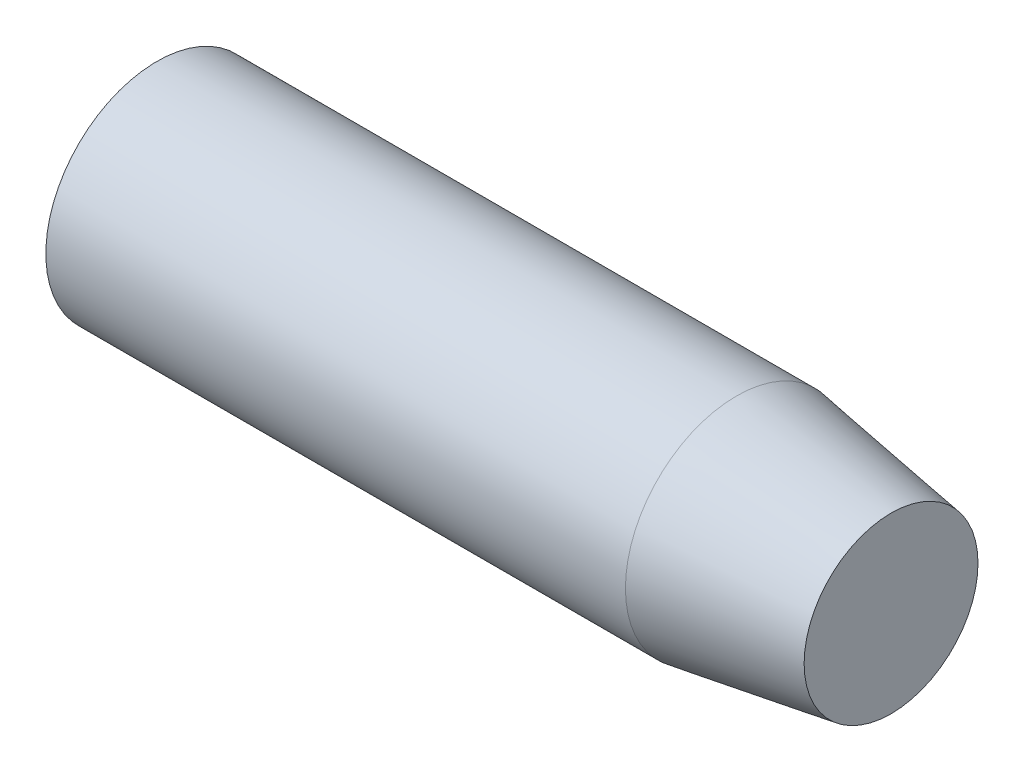
ISO-10303-21;
HEADER;
FILE_DESCRIPTION(('STEP AP214'),'2;1');
FILE_NAME('part.step','',(''),(''),'','','');
FILE_SCHEMA(('AUTOMOTIVE_DESIGN { 1 0 10303 214 1 1 1 1 }'));
ENDSEC;
DATA;
#1=APPLICATION_CONTEXT('core data for automotive mechanical design processes');
#2=APPLICATION_PROTOCOL_DEFINITION('international standard','automotive_design',2000,#1);
#3=PRODUCT_CONTEXT('',#1,'mechanical');
#4=PRODUCT('Part','Part','',(#3));
#5=PRODUCT_RELATED_PRODUCT_CATEGORY('part','',(#4));
#6=PRODUCT_DEFINITION_FORMATION('','',#4);
#7=PRODUCT_DEFINITION_CONTEXT('part definition',#1,'design');
#8=PRODUCT_DEFINITION('design','',#6,#7);
#9=PRODUCT_DEFINITION_SHAPE('','',#8);
#10=(LENGTH_UNIT() NAMED_UNIT(*) SI_UNIT(.MILLI.,.METRE.));
#11=(NAMED_UNIT(*) PLANE_ANGLE_UNIT() SI_UNIT($,.RADIAN.));
#12=(NAMED_UNIT(*) SI_UNIT($,.STERADIAN.) SOLID_ANGLE_UNIT());
#13=UNCERTAINTY_MEASURE_WITH_UNIT(LENGTH_MEASURE(1.E-05),#10,'distance_accuracy_value','');
#14=(GEOMETRIC_REPRESENTATION_CONTEXT(3) GLOBAL_UNCERTAINTY_ASSIGNED_CONTEXT((#13)) GLOBAL_UNIT_ASSIGNED_CONTEXT((#10,
#11,#12)) REPRESENTATION_CONTEXT('',''));
#15=CARTESIAN_POINT('',(0.,0.,0.));
#16=DIRECTION('',(0.,0.,1.));
#17=DIRECTION('',(1.,0.,0.));
#18=AXIS2_PLACEMENT_3D('',#15,#16,#17);
#19=CARTESIAN_POINT('',(120.65,0.,0.));
#20=DIRECTION('',(1.,0.,0.));
#21=DIRECTION('',(0.,0.,-1.));
#22=AXIS2_PLACEMENT_3D('',#19,#20,#21);
#23=PLANE('',#22);
#24=CARTESIAN_POINT('',(120.65,0.,0.));
#25=DIRECTION('',(-1.,0.,0.));
#26=DIRECTION('',(0.,0.,1.));
#27=AXIS2_PLACEMENT_3D('',#24,#25,#26);
#28=CIRCLE('',#27,14.287500000001);
#29=CARTESIAN_POINT('',(120.65,0.,14.287500000001));
#30=VERTEX_POINT('',#29);
#31=EDGE_CURVE('E18',#30,#30,#28,.T.);
#32=ORIENTED_EDGE('',*,*,#31,.F.);
#33=EDGE_LOOP('',(#32));
#34=FACE_BOUND('',#33,.T.);
#35=ADVANCED_FACE('F15',(#34),#23,.T.);
#36=CARTESIAN_POINT('',(0.,0.,0.));
#37=DIRECTION('',(1.,0.,0.));
#38=DIRECTION('',(0.,0.,-1.));
#39=AXIS2_PLACEMENT_3D('',#36,#37,#38);
#40=PLANE('',#39);
#41=CARTESIAN_POINT('',(0.,0.,0.));
#42=DIRECTION('',(1.,0.,0.));
#43=DIRECTION('',(0.,0.,-1.));
#44=AXIS2_PLACEMENT_3D('',#41,#42,#43);
#45=CIRCLE('',#44,18.25625);
#46=CARTESIAN_POINT('',(0.,0.,-18.25625));
#47=VERTEX_POINT('',#46);
#48=EDGE_CURVE('E22',#47,#47,#45,.T.);
#49=ORIENTED_EDGE('',*,*,#48,.F.);
#50=EDGE_LOOP('',(#49));
#51=FACE_BOUND('',#50,.T.);
#52=ADVANCED_FACE('F35',(#51),#40,.F.);
#53=CARTESIAN_POINT('',(95.25,0.,0.));
#54=DIRECTION('',(-1.,0.,0.));
#55=DIRECTION('',(0.,0.,1.));
#56=AXIS2_PLACEMENT_3D('',#53,#54,#55);
#57=CONICAL_SURFACE('',#56,18.2562500000002,0.154996741923907);
#58=CARTESIAN_POINT('',(95.25,0.,0.));
#59=DIRECTION('',(1.,0.,0.));
#60=DIRECTION('',(0.,0.,-1.));
#61=AXIS2_PLACEMENT_3D('',#58,#59,#60);
#62=CIRCLE('',#61,18.25625);
#63=CARTESIAN_POINT('',(95.25,0.,-18.25625));
#64=VERTEX_POINT('',#63);
#65=EDGE_CURVE('E10',#64,#64,#62,.F.);
#66=ORIENTED_EDGE('',*,*,#65,.F.);
#67=EDGE_LOOP('',(#66));
#68=FACE_BOUND('',#67,.T.);
#69=ORIENTED_EDGE('',*,*,#31,.T.);
#70=EDGE_LOOP('',(#69));
#71=FACE_BOUND('',#70,.T.);
#72=ADVANCED_FACE('F32',(#68,#71),#57,.T.);
#73=CARTESIAN_POINT('',(0.,0.,0.));
#74=DIRECTION('',(1.,0.,0.));
#75=DIRECTION('',(0.,0.,-1.));
#76=AXIS2_PLACEMENT_3D('',#73,#74,#75);
#77=CYLINDRICAL_SURFACE('',#76,18.25625);
#78=ORIENTED_EDGE('',*,*,#48,.T.);
#79=EDGE_LOOP('',(#78));
#80=FACE_BOUND('',#79,.T.);
#81=ORIENTED_EDGE('',*,*,#65,.T.);
#82=EDGE_LOOP('',(#81));
#83=FACE_BOUND('',#82,.T.);
#84=ADVANCED_FACE('F41',(#80,#83),#77,.T.);
#85=CLOSED_SHELL('',(#35,#52,#72,#84));
#86=MANIFOLD_SOLID_BREP('B1',#85);
#87=ADVANCED_BREP_SHAPE_REPRESENTATION('',(#18,#86),#14);
#88=SHAPE_DEFINITION_REPRESENTATION(#9,#87);
ENDSEC;
END-ISO-10303-21;
